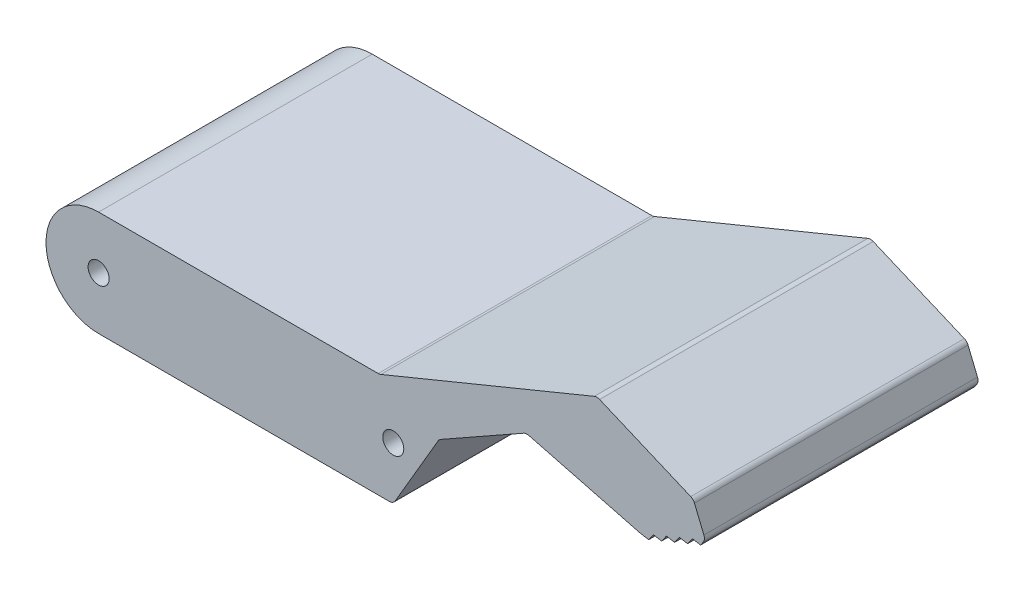
ISO-10303-21;
HEADER;
FILE_DESCRIPTION(('STEP AP214'),'2;1');
FILE_NAME('part.step','',(''),(''),'','','');
FILE_SCHEMA(('AUTOMOTIVE_DESIGN { 1 0 10303 214 1 1 1 1 }'));
ENDSEC;
DATA;
#1=APPLICATION_CONTEXT('core data for automotive mechanical design processes');
#2=APPLICATION_PROTOCOL_DEFINITION('international standard','automotive_design',2000,#1);
#3=PRODUCT_CONTEXT('',#1,'mechanical');
#4=PRODUCT('Part','Part','',(#3));
#5=PRODUCT_RELATED_PRODUCT_CATEGORY('part','',(#4));
#6=PRODUCT_DEFINITION_FORMATION('','',#4);
#7=PRODUCT_DEFINITION_CONTEXT('part definition',#1,'design');
#8=PRODUCT_DEFINITION('design','',#6,#7);
#9=PRODUCT_DEFINITION_SHAPE('','',#8);
#10=(LENGTH_UNIT() NAMED_UNIT(*) SI_UNIT(.MILLI.,.METRE.));
#11=(NAMED_UNIT(*) PLANE_ANGLE_UNIT() SI_UNIT($,.RADIAN.));
#12=(NAMED_UNIT(*) SI_UNIT($,.STERADIAN.) SOLID_ANGLE_UNIT());
#13=UNCERTAINTY_MEASURE_WITH_UNIT(LENGTH_MEASURE(1.E-05),#10,'distance_accuracy_value','');
#14=(GEOMETRIC_REPRESENTATION_CONTEXT(3) GLOBAL_UNCERTAINTY_ASSIGNED_CONTEXT((#13)) GLOBAL_UNIT_ASSIGNED_CONTEXT((#10,
#11,#12)) REPRESENTATION_CONTEXT('',''));
#15=CARTESIAN_POINT('',(0.,0.,0.));
#16=DIRECTION('',(0.,0.,1.));
#17=DIRECTION('',(1.,0.,0.));
#18=AXIS2_PLACEMENT_3D('',#15,#16,#17);
#19=CARTESIAN_POINT('',(34.5920003896083,-20.1914119043618,39.));
#20=DIRECTION('',(0.863640377947011,-0.504108418477161,0.));
#21=DIRECTION('',(0.504108418477161,0.863640377947011,0.));
#22=AXIS2_PLACEMENT_3D('',#19,#20,#21);
#23=PLANE('',#22);
#24=DIRECTION('',(-0.504108418477161,-0.863640377947011,0.));
#25=VECTOR('',#24,1.);
#26=CARTESIAN_POINT('',(34.5920003896083,-20.1914119043618,0.));
#27=LINE('',#26,#25);
#28=CARTESIAN_POINT('',(48.3941661538453,3.45450873533294,0.));
#29=VERTEX_POINT('',#28);
#30=CARTESIAN_POINT('',(42.289452794567,-7.00410841847716,0.));
#31=VERTEX_POINT('',#30);
#32=EDGE_CURVE('E352',#29,#31,#27,.T.);
#33=ORIENTED_EDGE('',*,*,#32,.F.);
#34=DIRECTION('',(0.,0.,-1.));
#35=VECTOR('',#34,1.);
#36=CARTESIAN_POINT('',(48.3941661538453,3.45450873533293,39.));
#37=LINE('',#36,#35);
#38=CARTESIAN_POINT('',(48.3941661538453,3.45450873533294,39.));
#39=VERTEX_POINT('',#38);
#40=EDGE_CURVE('E255',#29,#39,#37,.F.);
#41=ORIENTED_EDGE('',*,*,#40,.T.);
#42=DIRECTION('',(-0.504108418477161,-0.863640377947011,0.));
#43=VECTOR('',#42,1.);
#44=CARTESIAN_POINT('',(34.5920003896083,-20.1914119043618,39.));
#45=LINE('',#44,#43);
#46=CARTESIAN_POINT('',(42.289452794567,-7.00410841847716,39.));
#47=VERTEX_POINT('',#46);
#48=EDGE_CURVE('E769',#39,#47,#45,.T.);
#49=ORIENTED_EDGE('',*,*,#48,.T.);
#50=DIRECTION('',(0.,0.,-1.));
#51=VECTOR('',#50,1.);
#52=CARTESIAN_POINT('',(42.289452794567,-7.00410841847716,0.));
#53=LINE('',#52,#51);
#54=EDGE_CURVE('E252',#47,#31,#53,.T.);
#55=ORIENTED_EDGE('',*,*,#54,.T.);
#56=EDGE_LOOP('',(#33,#41,#49,#55));
#57=FACE_BOUND('',#56,.T.);
#58=ADVANCED_FACE('F35',(#57),#23,.T.);
#59=CARTESIAN_POINT('',(10.1563340407783,-17.9837401161387,39.));
#60=DIRECTION('',(0.49174940484091,-0.870736770119771,0.));
#61=DIRECTION('',(0.870736770119771,0.49174940484091,0.));
#62=AXIS2_PLACEMENT_3D('',#59,#60,#61);
#63=PLANE('',#62);
#64=DIRECTION('',(-0.870736770119771,-0.49174940484091,0.));
#65=VECTOR('',#64,1.);
#66=CARTESIAN_POINT('',(10.1563340407783,-17.9837401161387,39.));
#67=LINE('',#66,#65);
#68=CARTESIAN_POINT('',(60.5780168914764,10.4919524051468,39.));
#69=VERTEX_POINT('',#68);
#70=CARTESIAN_POINT('',(48.7660571269514,3.82113708697554,39.));
#71=VERTEX_POINT('',#70);
#72=EDGE_CURVE('E776',#69,#71,#67,.T.);
#73=ORIENTED_EDGE('',*,*,#72,.T.);
#74=DIRECTION('',(0.,0.,-1.));
#75=VECTOR('',#74,1.);
#76=CARTESIAN_POINT('',(48.7660571269514,3.82113708697554,0.));
#77=LINE('',#76,#75);
#78=CARTESIAN_POINT('',(48.7660571269514,3.82113708697554,0.));
#79=VERTEX_POINT('',#78);
#80=EDGE_CURVE('E244',#71,#79,#77,.T.);
#81=ORIENTED_EDGE('',*,*,#80,.T.);
#82=DIRECTION('',(-0.870736770119771,-0.49174940484091,0.));
#83=VECTOR('',#82,1.);
#84=CARTESIAN_POINT('',(10.1563340407783,-17.9837401161387,0.));
#85=LINE('',#84,#83);
#86=CARTESIAN_POINT('',(60.5780168914764,10.4919524051468,0.));
#87=VERTEX_POINT('',#86);
#88=EDGE_CURVE('E354',#87,#79,#85,.T.);
#89=ORIENTED_EDGE('',*,*,#88,.F.);
#90=DIRECTION('',(0.,0.,-1.));
#91=VECTOR('',#90,1.);
#92=CARTESIAN_POINT('',(60.5780168914764,10.4919524051468,39.));
#93=LINE('',#92,#91);
#94=EDGE_CURVE('E242',#87,#69,#93,.F.);
#95=ORIENTED_EDGE('',*,*,#94,.T.);
#96=EDGE_LOOP('',(#73,#81,#89,#95));
#97=FACE_BOUND('',#96,.T.);
#98=ADVANCED_FACE('F497',(#97),#63,.T.);
#99=CARTESIAN_POINT('',(6.44130494107222,24.8273469280204,39.));
#100=DIRECTION('',(-0.251129667135222,-0.967953454606446,0.));
#101=DIRECTION('',(0.967953454606446,-0.251129667135222,0.));
#102=AXIS2_PLACEMENT_3D('',#99,#100,#101);
#103=PLANE('',#102);
#104=DIRECTION('',(-0.967953454606446,0.251129667135222,0.));
#105=VECTOR('',#104,1.);
#106=CARTESIAN_POINT('',(6.44130494107222,24.8273469280204,39.));
#107=LINE('',#106,#105);
#108=CARTESIAN_POINT('',(77.1999478832336,6.46944514623497,39.));
#109=VERTEX_POINT('',#108);
#110=CARTESIAN_POINT('',(61.3208959634526,10.5891690896335,39.));
#111=VERTEX_POINT('',#110);
#112=EDGE_CURVE('E227',#109,#111,#107,.T.);
#113=ORIENTED_EDGE('',*,*,#112,.T.);
#114=DIRECTION('',(0.,0.,-1.));
#115=VECTOR('',#114,1.);
#116=CARTESIAN_POINT('',(61.3208959634526,10.5891690896335,0.));
#117=LINE('',#116,#115);
#118=CARTESIAN_POINT('',(61.3208959634526,10.5891690896335,0.));
#119=VERTEX_POINT('',#118);
#120=EDGE_CURVE('E279',#111,#119,#117,.T.);
#121=ORIENTED_EDGE('',*,*,#120,.T.);
#122=DIRECTION('',(-0.967953454606446,0.251129667135222,0.));
#123=VECTOR('',#122,1.);
#124=CARTESIAN_POINT('',(6.44130494107222,24.8273469280204,0.));
#125=LINE('',#124,#123);
#126=CARTESIAN_POINT('',(77.1999478832336,6.46944514623497,0.));
#127=VERTEX_POINT('',#126);
#128=EDGE_CURVE('E357',#127,#119,#125,.T.);
#129=ORIENTED_EDGE('',*,*,#128,.F.);
#130=DIRECTION('',(0.,0.,-1.));
#131=VECTOR('',#130,1.);
#132=CARTESIAN_POINT('',(77.1999478832335,6.46944514623497,39.));
#133=LINE('',#132,#131);
#134=EDGE_CURVE('E277',#127,#109,#133,.F.);
#135=ORIENTED_EDGE('',*,*,#134,.T.);
#136=EDGE_LOOP('',(#113,#121,#129,#135));
#137=FACE_BOUND('',#136,.T.);
#138=ADVANCED_FACE('F503',(#137),#103,.T.);
#139=CARTESIAN_POINT('',(3.3552008629179,19.302142192717,39.));
#140=DIRECTION('',(0.171257275030367,0.985226342395073,0.));
#141=DIRECTION('',(-0.985226342395073,0.171257275030367,0.));
#142=AXIS2_PLACEMENT_3D('',#139,#140,#141);
#143=PLANE('',#142);
#144=DIRECTION('',(0.985226342395073,-0.171257275030367,0.));
#145=VECTOR('',#144,1.);
#146=CARTESIAN_POINT('',(3.3552008629179,19.302142192717,39.));
#147=LINE('',#146,#145);
#148=CARTESIAN_POINT('',(77.2798202753384,6.45217225844635,39.));
#149=VERTEX_POINT('',#148);
#150=CARTESIAN_POINT('',(78.4039750829053,6.25676569979893,39.));
#151=VERTEX_POINT('',#150);
#152=EDGE_CURVE('E213',#149,#151,#147,.T.);
#153=ORIENTED_EDGE('',*,*,#152,.F.);
#154=DIRECTION('',(0.,0.,-1.));
#155=VECTOR('',#154,1.);
#156=CARTESIAN_POINT('',(77.2798202753384,6.45217225844634,0.));
#157=LINE('',#156,#155);
#158=CARTESIAN_POINT('',(77.2798202753384,6.45217225844635,0.));
#159=VERTEX_POINT('',#158);
#160=EDGE_CURVE('E282',#149,#159,#157,.T.);
#161=ORIENTED_EDGE('',*,*,#160,.T.);
#162=DIRECTION('',(0.985226342395073,-0.171257275030367,0.));
#163=VECTOR('',#162,1.);
#164=CARTESIAN_POINT('',(3.3552008629179,19.302142192717,0.));
#165=LINE('',#164,#163);
#166=CARTESIAN_POINT('',(78.4039750829053,6.25676569979893,0.));
#167=VERTEX_POINT('',#166);
#168=EDGE_CURVE('E240',#159,#167,#165,.T.);
#169=ORIENTED_EDGE('',*,*,#168,.T.);
#170=DIRECTION('',(0.,0.,-1.));
#171=VECTOR('',#170,1.);
#172=CARTESIAN_POINT('',(78.4039750829053,6.25676569979893,39.));
#173=LINE('',#172,#171);
#174=EDGE_CURVE('E233',#151,#167,#173,.T.);
#175=ORIENTED_EDGE('',*,*,#174,.F.);
#176=EDGE_LOOP('',(#153,#161,#169,#175));
#177=FACE_BOUND('',#176,.T.);
#178=ADVANCED_FACE('F238',(#177),#143,.F.);
#179=CARTESIAN_POINT('',(49.0879376952955,-34.935387273559,39.));
#180=DIRECTION('',(-0.814732571298568,0.579836905746111,0.));
#181=DIRECTION('',(-0.579836905746111,-0.814732571298568,0.));
#182=AXIS2_PLACEMENT_3D('',#179,#180,#181);
#183=PLANE('',#182);
#184=DIRECTION('',(0.579836905746111,0.814732571298568,0.));
#185=VECTOR('',#184,1.);
#186=CARTESIAN_POINT('',(49.0879376952955,-34.935387273559,0.));
#187=LINE('',#186,#185);
#188=CARTESIAN_POINT('',(79.08928736105,7.21970239627707,0.));
#189=VERTEX_POINT('',#188);
#190=EDGE_CURVE('E361',#167,#189,#187,.T.);
#191=ORIENTED_EDGE('',*,*,#190,.T.);
#192=DIRECTION('',(0.,0.,-1.));
#193=VECTOR('',#192,1.);
#194=CARTESIAN_POINT('',(79.08928736105,7.21970239627707,39.));
#195=LINE('',#194,#193);
#196=CARTESIAN_POINT('',(79.08928736105,7.21970239627707,39.));
#197=VERTEX_POINT('',#196);
#198=EDGE_CURVE('E235',#197,#189,#195,.T.);
#199=ORIENTED_EDGE('',*,*,#198,.F.);
#200=DIRECTION('',(0.579836905746111,0.814732571298568,0.));
#201=VECTOR('',#200,1.);
#202=CARTESIAN_POINT('',(49.0879376952955,-34.935387273559,39.));
#203=LINE('',#202,#201);
#204=EDGE_CURVE('E218',#151,#197,#203,.T.);
#205=ORIENTED_EDGE('',*,*,#204,.F.);
#206=ORIENTED_EDGE('',*,*,#174,.T.);
#207=EDGE_LOOP('',(#191,#199,#205,#206));
#208=FACE_BOUND('',#207,.T.);
#209=ADVANCED_FACE('F232',(#208),#183,.F.);
#210=CARTESIAN_POINT('',(3.53777401595302,20.3524676737947,39.));
#211=DIRECTION('',(0.171257275030367,0.985226342395073,0.));
#212=DIRECTION('',(-0.985226342395073,0.171257275030367,0.));
#213=AXIS2_PLACEMENT_3D('',#210,#211,#212);
#214=PLANE('',#213);
#215=DIRECTION('',(0.985226342395073,-0.171257275030367,0.));
#216=VECTOR('',#215,1.);
#217=CARTESIAN_POINT('',(3.53777401595302,20.3524676737947,0.));
#218=LINE('',#217,#216);
#219=CARTESIAN_POINT('',(80.2537315392384,7.01729252526535,0.));
#220=VERTEX_POINT('',#219);
#221=EDGE_CURVE('E363',#189,#220,#218,.T.);
#222=ORIENTED_EDGE('',*,*,#221,.T.);
#223=DIRECTION('',(0.,0.,-1.));
#224=VECTOR('',#223,1.);
#225=CARTESIAN_POINT('',(80.2537315392384,7.01729252526535,39.));
#226=LINE('',#225,#224);
#227=CARTESIAN_POINT('',(80.2537315392384,7.01729252526535,39.));
#228=VERTEX_POINT('',#227);
#229=EDGE_CURVE('E246',#228,#220,#226,.T.);
#230=ORIENTED_EDGE('',*,*,#229,.F.);
#231=DIRECTION('',(0.985226342395073,-0.171257275030367,0.));
#232=VECTOR('',#231,1.);
#233=CARTESIAN_POINT('',(3.53777401595302,20.3524676737947,39.));
#234=LINE('',#233,#232);
#235=EDGE_CURVE('E236',#197,#228,#234,.T.);
#236=ORIENTED_EDGE('',*,*,#235,.F.);
#237=ORIENTED_EDGE('',*,*,#198,.T.);
#238=EDGE_LOOP('',(#222,#230,#236,#237));
#239=FACE_BOUND('',#238,.T.);
#240=ADVANCED_FACE('F428',(#239),#214,.F.);
#241=CARTESIAN_POINT('',(49.9565039760335,-35.553537084184,39.));
#242=DIRECTION('',(-0.814732571298571,0.579836905746107,0.));
#243=DIRECTION('',(-0.579836905746107,-0.814732571298571,0.));
#244=AXIS2_PLACEMENT_3D('',#241,#242,#243);
#245=PLANE('',#244);
#246=DIRECTION('',(0.579836905746107,0.814732571298571,0.));
#247=VECTOR('',#246,1.);
#248=CARTESIAN_POINT('',(49.9565039760335,-35.553537084184,0.));
#249=LINE('',#248,#247);
#250=CARTESIAN_POINT('',(80.9390438173831,7.98022922174349,0.));
#251=VERTEX_POINT('',#250);
#252=EDGE_CURVE('E366',#220,#251,#249,.T.);
#253=ORIENTED_EDGE('',*,*,#252,.T.);
#254=DIRECTION('',(0.,0.,-1.));
#255=VECTOR('',#254,1.);
#256=CARTESIAN_POINT('',(80.9390438173831,7.98022922174349,39.));
#257=LINE('',#256,#255);
#258=CARTESIAN_POINT('',(80.9390438173831,7.98022922174349,39.));
#259=VERTEX_POINT('',#258);
#260=EDGE_CURVE('E418',#259,#251,#257,.T.);
#261=ORIENTED_EDGE('',*,*,#260,.F.);
#262=DIRECTION('',(0.579836905746107,0.814732571298571,0.));
#263=VECTOR('',#262,1.);
#264=CARTESIAN_POINT('',(49.9565039760335,-35.553537084184,39.));
#265=LINE('',#264,#263);
#266=EDGE_CURVE('E426',#228,#259,#265,.T.);
#267=ORIENTED_EDGE('',*,*,#266,.F.);
#268=ORIENTED_EDGE('',*,*,#229,.T.);
#269=EDGE_LOOP('',(#253,#261,#267,#268));
#270=FACE_BOUND('',#269,.T.);
#271=ADVANCED_FACE('F423',(#270),#245,.F.);
#272=CARTESIAN_POINT('',(3.72034716898818,21.4027931548725,39.));
#273=DIRECTION('',(0.171257275030368,0.985226342395073,0.));
#274=DIRECTION('',(-0.985226342395073,0.171257275030368,0.));
#275=AXIS2_PLACEMENT_3D('',#272,#273,#274);
#276=PLANE('',#275);
#277=DIRECTION('',(0.985226342395073,-0.171257275030368,0.));
#278=VECTOR('',#277,1.);
#279=CARTESIAN_POINT('',(3.72034716898818,21.4027931548725,0.));
#280=LINE('',#279,#278);
#281=CARTESIAN_POINT('',(82.1034879955715,7.77781935073177,0.));
#282=VERTEX_POINT('',#281);
#283=EDGE_CURVE('E369',#251,#282,#280,.T.);
#284=ORIENTED_EDGE('',*,*,#283,.T.);
#285=DIRECTION('',(0.,0.,-1.));
#286=VECTOR('',#285,1.);
#287=CARTESIAN_POINT('',(82.1034879955715,7.77781935073177,39.));
#288=LINE('',#287,#286);
#289=CARTESIAN_POINT('',(82.1034879955715,7.77781935073177,39.));
#290=VERTEX_POINT('',#289);
#291=EDGE_CURVE('E415',#290,#282,#288,.T.);
#292=ORIENTED_EDGE('',*,*,#291,.F.);
#293=DIRECTION('',(0.985226342395073,-0.171257275030368,0.));
#294=VECTOR('',#293,1.);
#295=CARTESIAN_POINT('',(3.72034716898818,21.4027931548725,39.));
#296=LINE('',#295,#294);
#297=EDGE_CURVE('E433',#259,#290,#296,.T.);
#298=ORIENTED_EDGE('',*,*,#297,.F.);
#299=ORIENTED_EDGE('',*,*,#260,.T.);
#300=EDGE_LOOP('',(#284,#292,#298,#299));
#301=FACE_BOUND('',#300,.T.);
#302=ADVANCED_FACE('F431',(#301),#276,.F.);
#303=CARTESIAN_POINT('',(50.8250702567709,-36.1716868948092,39.));
#304=DIRECTION('',(-0.814732571298569,0.57983690574611,0.));
#305=DIRECTION('',(-0.57983690574611,-0.814732571298569,0.));
#306=AXIS2_PLACEMENT_3D('',#303,#304,#305);
#307=PLANE('',#306);
#308=DIRECTION('',(0.579836905746109,0.814732571298569,0.));
#309=VECTOR('',#308,1.);
#310=CARTESIAN_POINT('',(50.8250702567709,-36.1716868948092,0.));
#311=LINE('',#310,#309);
#312=CARTESIAN_POINT('',(82.7888002737162,8.7407560472099,0.));
#313=VERTEX_POINT('',#312);
#314=EDGE_CURVE('E372',#282,#313,#311,.T.);
#315=ORIENTED_EDGE('',*,*,#314,.T.);
#316=DIRECTION('',(0.,0.,-1.));
#317=VECTOR('',#316,1.);
#318=CARTESIAN_POINT('',(82.7888002737162,8.7407560472099,39.));
#319=LINE('',#318,#317);
#320=CARTESIAN_POINT('',(82.7888002737162,8.7407560472099,39.));
#321=VERTEX_POINT('',#320);
#322=EDGE_CURVE('E412',#321,#313,#319,.T.);
#323=ORIENTED_EDGE('',*,*,#322,.F.);
#324=DIRECTION('',(0.579836905746109,0.814732571298569,0.));
#325=VECTOR('',#324,1.);
#326=CARTESIAN_POINT('',(50.8250702567709,-36.1716868948092,39.));
#327=LINE('',#326,#325);
#328=EDGE_CURVE('E435',#290,#321,#327,.T.);
#329=ORIENTED_EDGE('',*,*,#328,.F.);
#330=ORIENTED_EDGE('',*,*,#291,.T.);
#331=EDGE_LOOP('',(#315,#323,#329,#330));
#332=FACE_BOUND('',#331,.T.);
#333=ADVANCED_FACE('F487',(#332),#307,.F.);
#334=CARTESIAN_POINT('',(3.90292032202358,22.4531186359508,39.));
#335=DIRECTION('',(0.171257275030376,0.985226342395071,0.));
#336=DIRECTION('',(-0.985226342395071,0.171257275030376,0.));
#337=AXIS2_PLACEMENT_3D('',#334,#335,#336);
#338=PLANE('',#337);
#339=DIRECTION('',(0.985226342395071,-0.171257275030376,0.));
#340=VECTOR('',#339,1.);
#341=CARTESIAN_POINT('',(3.90292032202358,22.4531186359508,0.));
#342=LINE('',#341,#340);
#343=CARTESIAN_POINT('',(83.9532444519046,8.53834617619818,0.));
#344=VERTEX_POINT('',#343);
#345=EDGE_CURVE('E375',#313,#344,#342,.T.);
#346=ORIENTED_EDGE('',*,*,#345,.T.);
#347=DIRECTION('',(0.,0.,-1.));
#348=VECTOR('',#347,1.);
#349=CARTESIAN_POINT('',(83.9532444519046,8.53834617619818,39.));
#350=LINE('',#349,#348);
#351=CARTESIAN_POINT('',(83.9532444519046,8.53834617619818,39.));
#352=VERTEX_POINT('',#351);
#353=EDGE_CURVE('E409',#352,#344,#350,.T.);
#354=ORIENTED_EDGE('',*,*,#353,.F.);
#355=DIRECTION('',(0.985226342395071,-0.171257275030376,0.));
#356=VECTOR('',#355,1.);
#357=CARTESIAN_POINT('',(3.90292032202358,22.4531186359508,39.));
#358=LINE('',#357,#356);
#359=EDGE_CURVE('E441',#321,#352,#358,.T.);
#360=ORIENTED_EDGE('',*,*,#359,.F.);
#361=ORIENTED_EDGE('',*,*,#322,.T.);
#362=EDGE_LOOP('',(#346,#354,#360,#361));
#363=FACE_BOUND('',#362,.T.);
#364=ADVANCED_FACE('F484',(#363),#338,.F.);
#365=CARTESIAN_POINT('',(51.69363653751,-36.789836705434,39.));
#366=DIRECTION('',(-0.814732571298579,0.579836905746095,0.));
#367=DIRECTION('',(-0.579836905746095,-0.814732571298579,0.));
#368=AXIS2_PLACEMENT_3D('',#365,#366,#367);
#369=PLANE('',#368);
#370=DIRECTION('',(0.579836905746095,0.814732571298579,0.));
#371=VECTOR('',#370,1.);
#372=CARTESIAN_POINT('',(51.69363653751,-36.789836705434,0.));
#373=LINE('',#372,#371);
#374=CARTESIAN_POINT('',(84.6385567300492,9.50128287267631,0.));
#375=VERTEX_POINT('',#374);
#376=EDGE_CURVE('E378',#344,#375,#373,.T.);
#377=ORIENTED_EDGE('',*,*,#376,.T.);
#378=DIRECTION('',(0.,0.,-1.));
#379=VECTOR('',#378,1.);
#380=CARTESIAN_POINT('',(84.6385567300492,9.50128287267631,39.));
#381=LINE('',#380,#379);
#382=CARTESIAN_POINT('',(84.6385567300492,9.50128287267631,39.));
#383=VERTEX_POINT('',#382);
#384=EDGE_CURVE('E406',#383,#375,#381,.T.);
#385=ORIENTED_EDGE('',*,*,#384,.F.);
#386=DIRECTION('',(0.579836905746095,0.814732571298579,0.));
#387=VECTOR('',#386,1.);
#388=CARTESIAN_POINT('',(51.69363653751,-36.789836705434,39.));
#389=LINE('',#388,#387);
#390=EDGE_CURVE('E444',#352,#383,#389,.T.);
#391=ORIENTED_EDGE('',*,*,#390,.F.);
#392=ORIENTED_EDGE('',*,*,#353,.T.);
#393=EDGE_LOOP('',(#377,#385,#391,#392));
#394=FACE_BOUND('',#393,.T.);
#395=ADVANCED_FACE('F482',(#394),#369,.F.);
#396=CARTESIAN_POINT('',(4.08549347505868,23.5034441170285,39.));
#397=DIRECTION('',(0.171257275030375,0.985226342395072,0.));
#398=DIRECTION('',(-0.985226342395072,0.171257275030375,0.));
#399=AXIS2_PLACEMENT_3D('',#396,#397,#398);
#400=PLANE('',#399);
#401=DIRECTION('',(0.985226342395071,-0.171257275030375,0.));
#402=VECTOR('',#401,1.);
#403=CARTESIAN_POINT('',(4.08549347505868,23.5034441170285,0.));
#404=LINE('',#403,#402);
#405=CARTESIAN_POINT('',(85.8030009082377,9.29887300166459,0.));
#406=VERTEX_POINT('',#405);
#407=EDGE_CURVE('E381',#375,#406,#404,.T.);
#408=ORIENTED_EDGE('',*,*,#407,.T.);
#409=DIRECTION('',(0.,0.,-1.));
#410=VECTOR('',#409,1.);
#411=CARTESIAN_POINT('',(85.8030009082377,9.29887300166459,39.));
#412=LINE('',#411,#410);
#413=CARTESIAN_POINT('',(85.8030009082377,9.29887300166459,39.));
#414=VERTEX_POINT('',#413);
#415=EDGE_CURVE('E403',#414,#406,#412,.T.);
#416=ORIENTED_EDGE('',*,*,#415,.F.);
#417=DIRECTION('',(0.985226342395071,-0.171257275030375,0.));
#418=VECTOR('',#417,1.);
#419=CARTESIAN_POINT('',(4.08549347505868,23.5034441170285,39.));
#420=LINE('',#419,#418);
#421=EDGE_CURVE('E447',#383,#414,#420,.T.);
#422=ORIENTED_EDGE('',*,*,#421,.F.);
#423=ORIENTED_EDGE('',*,*,#384,.T.);
#424=EDGE_LOOP('',(#408,#416,#422,#423));
#425=FACE_BOUND('',#424,.T.);
#426=ADVANCED_FACE('F478',(#425),#400,.F.);
#427=CARTESIAN_POINT('',(52.562202818246,-37.4079865160595,39.));
#428=DIRECTION('',(-0.814732571298567,0.579836905746111,0.));
#429=DIRECTION('',(-0.579836905746111,-0.814732571298567,0.));
#430=AXIS2_PLACEMENT_3D('',#427,#428,#429);
#431=PLANE('',#430);
#432=DIRECTION('',(0.579836905746111,0.814732571298567,0.));
#433=VECTOR('',#432,1.);
#434=CARTESIAN_POINT('',(52.562202818246,-37.4079865160595,0.));
#435=LINE('',#434,#433);
#436=CARTESIAN_POINT('',(86.1682981588578,9.81215452158268,0.));
#437=VERTEX_POINT('',#436);
#438=EDGE_CURVE('E384',#406,#437,#435,.T.);
#439=ORIENTED_EDGE('',*,*,#438,.T.);
#440=DIRECTION('',(0.,0.,-1.));
#441=VECTOR('',#440,1.);
#442=CARTESIAN_POINT('',(86.1682981588578,9.81215452158268,39.));
#443=LINE('',#442,#441);
#444=CARTESIAN_POINT('',(86.1682981588578,9.81215452158268,39.));
#445=VERTEX_POINT('',#444);
#446=EDGE_CURVE('E289',#437,#445,#443,.F.);
#447=ORIENTED_EDGE('',*,*,#446,.T.);
#448=DIRECTION('',(0.579836905746111,0.814732571298567,0.));
#449=VECTOR('',#448,1.);
#450=CARTESIAN_POINT('',(52.562202818246,-37.4079865160595,39.));
#451=LINE('',#450,#449);
#452=EDGE_CURVE('E450',#414,#445,#451,.T.);
#453=ORIENTED_EDGE('',*,*,#452,.F.);
#454=ORIENTED_EDGE('',*,*,#415,.T.);
#455=EDGE_LOOP('',(#439,#447,#453,#454));
#456=FACE_BOUND('',#455,.T.);
#457=ADVANCED_FACE('F475',(#456),#431,.F.);
#458=CARTESIAN_POINT('',(77.5911316391743,31.9015710570176,39.));
#459=DIRECTION('',(0.92487822816655,0.380263412733204,0.));
#460=DIRECTION('',(-0.380263412733204,0.92487822816655,0.));
#461=AXIS2_PLACEMENT_3D('',#458,#459,#460);
#462=PLANE('',#461);
#463=DIRECTION('',(0.380263412733204,-0.92487822816655,0.));
#464=VECTOR('',#463,1.);
#465=CARTESIAN_POINT('',(77.5911316391743,31.9015710570176,39.));
#466=LINE('',#465,#464);
#467=CARTESIAN_POINT('',(84.9335367393822,14.043343333369,39.));
#468=VERTEX_POINT('',#467);
#469=CARTESIAN_POINT('',(86.2784438157257,10.772254840062,39.));
#470=VERTEX_POINT('',#469);
#471=EDGE_CURVE('E453',#468,#470,#466,.T.);
#472=ORIENTED_EDGE('',*,*,#471,.T.);
#473=DIRECTION('',(0.,0.,-1.));
#474=VECTOR('',#473,1.);
#475=CARTESIAN_POINT('',(86.2784438157257,10.772254840062,0.));
#476=LINE('',#475,#474);
#477=CARTESIAN_POINT('',(86.2784438157257,10.772254840062,0.));
#478=VERTEX_POINT('',#477);
#479=EDGE_CURVE('E286',#470,#478,#476,.T.);
#480=ORIENTED_EDGE('',*,*,#479,.T.);
#481=DIRECTION('',(0.380263412733204,-0.92487822816655,0.));
#482=VECTOR('',#481,1.);
#483=CARTESIAN_POINT('',(77.5911316391743,31.9015710570176,0.));
#484=LINE('',#483,#482);
#485=CARTESIAN_POINT('',(84.9335367393822,14.043343333369,0.));
#486=VERTEX_POINT('',#485);
#487=EDGE_CURVE('E387',#486,#478,#484,.T.);
#488=ORIENTED_EDGE('',*,*,#487,.F.);
#489=DIRECTION('',(0.,0.,-1.));
#490=VECTOR('',#489,1.);
#491=CARTESIAN_POINT('',(84.9335367393822,14.043343333369,39.));
#492=LINE('',#491,#490);
#493=EDGE_CURVE('E284',#486,#468,#492,.F.);
#494=ORIENTED_EDGE('',*,*,#493,.T.);
#495=EDGE_LOOP('',(#472,#480,#488,#494));
#496=FACE_BOUND('',#495,.T.);
#497=ADVANCED_FACE('F467',(#496),#462,.T.);
#498=CARTESIAN_POINT('',(18.048535975218,42.657114903488,39.));
#499=DIRECTION('',(0.389663705776961,0.920957217464615,0.));
#500=DIRECTION('',(-0.920957217464615,0.389663705776961,0.));
#501=AXIS2_PLACEMENT_3D('',#498,#499,#500);
#502=PLANE('',#501);
#503=DIRECTION('',(0.920957217464615,-0.389663705776961,0.));
#504=VECTOR('',#503,1.);
#505=CARTESIAN_POINT('',(18.048535975218,42.657114903488,39.));
#506=LINE('',#505,#504);
#507=CARTESIAN_POINT('',(71.4175664450873,20.0762894403206,39.));
#508=VERTEX_POINT('',#507);
#509=CARTESIAN_POINT('',(84.3983222169927,14.5840371381004,39.));
#510=VERTEX_POINT('',#509);
#511=EDGE_CURVE('E340',#508,#510,#506,.T.);
#512=ORIENTED_EDGE('',*,*,#511,.T.);
#513=DIRECTION('',(0.,0.,-1.));
#514=VECTOR('',#513,1.);
#515=CARTESIAN_POINT('',(84.3983222169926,14.5840371381004,39.));
#516=LINE('',#515,#514);
#517=CARTESIAN_POINT('',(84.3983222169927,14.5840371381004,0.));
#518=VERTEX_POINT('',#517);
#519=EDGE_CURVE('E293',#510,#518,#516,.T.);
#520=ORIENTED_EDGE('',*,*,#519,.T.);
#521=DIRECTION('',(0.920957217464615,-0.389663705776961,0.));
#522=VECTOR('',#521,1.);
#523=CARTESIAN_POINT('',(18.048535975218,42.657114903488,0.));
#524=LINE('',#523,#522);
#525=CARTESIAN_POINT('',(71.4175664450873,20.0762894403206,0.));
#526=VERTEX_POINT('',#525);
#527=EDGE_CURVE('E327',#526,#518,#524,.T.);
#528=ORIENTED_EDGE('',*,*,#527,.F.);
#529=DIRECTION('',(0.,0.,-1.));
#530=VECTOR('',#529,1.);
#531=CARTESIAN_POINT('',(71.4175664450873,20.0762894403206,39.));
#532=LINE('',#531,#530);
#533=EDGE_CURVE('E291',#526,#508,#532,.F.);
#534=ORIENTED_EDGE('',*,*,#533,.T.);
#535=EDGE_LOOP('',(#512,#520,#528,#534));
#536=FACE_BOUND('',#535,.T.);
#537=ADVANCED_FACE('F458',(#536),#502,.T.);
#538=CARTESIAN_POINT('',(3.15351040015397,-7.66998089675667,39.));
#539=DIRECTION('',(-0.380263412733206,0.924878228166549,0.));
#540=DIRECTION('',(-0.924878228166549,-0.380263412733207,0.));
#541=AXIS2_PLACEMENT_3D('',#538,#539,#540);
#542=PLANE('',#541);
#543=DIRECTION('',(0.924878228166549,0.380263412733207,0.));
#544=VECTOR('',#543,1.);
#545=CARTESIAN_POINT('',(3.15351040015397,-7.66998089675667,39.));
#546=LINE('',#545,#544);
#547=CARTESIAN_POINT('',(40.2327114807882,7.57512177183346,39.));
#548=VERTEX_POINT('',#547);
#549=CARTESIAN_POINT('',(70.6476393265771,20.0802104510225,39.));
#550=VERTEX_POINT('',#549);
#551=EDGE_CURVE('E336',#548,#550,#546,.T.);
#552=ORIENTED_EDGE('',*,*,#551,.T.);
#553=DIRECTION('',(0.,0.,-1.));
#554=VECTOR('',#553,1.);
#555=CARTESIAN_POINT('',(70.6476393265771,20.0802104510225,39.));
#556=LINE('',#555,#554);
#557=CARTESIAN_POINT('',(70.6476393265771,20.0802104510225,0.));
#558=VERTEX_POINT('',#557);
#559=EDGE_CURVE('E298',#550,#558,#556,.T.);
#560=ORIENTED_EDGE('',*,*,#559,.T.);
#561=DIRECTION('',(0.924878228166549,0.380263412733207,0.));
#562=VECTOR('',#561,1.);
#563=CARTESIAN_POINT('',(3.15351040015397,-7.66998089675667,0.));
#564=LINE('',#563,#562);
#565=CARTESIAN_POINT('',(40.2327114807882,7.57512177183346,0.));
#566=VERTEX_POINT('',#565);
#567=EDGE_CURVE('E317',#566,#558,#564,.T.);
#568=ORIENTED_EDGE('',*,*,#567,.F.);
#569=DIRECTION('',(0.,0.,-1.));
#570=VECTOR('',#569,1.);
#571=CARTESIAN_POINT('',(40.2327114807882,7.57512177183345,39.));
#572=LINE('',#571,#570);
#573=EDGE_CURVE('E296',#566,#548,#572,.F.);
#574=ORIENTED_EDGE('',*,*,#573,.T.);
#575=EDGE_LOOP('',(#552,#560,#568,#574));
#576=FACE_BOUND('',#575,.T.);
#577=ADVANCED_FACE('F325',(#576),#542,.T.);
#578=CARTESIAN_POINT('',(0.,7.5,39.));
#579=DIRECTION('',(0.,1.,0.));
#580=DIRECTION('',(-1.,0.,0.));
#581=AXIS2_PLACEMENT_3D('',#578,#579,#580);
#582=PLANE('',#581);
#583=DIRECTION('',(1.,0.,0.));
#584=VECTOR('',#583,1.);
#585=CARTESIAN_POINT('',(0.,7.5,39.));
#586=LINE('',#585,#584);
#587=CARTESIAN_POINT('',(0.,7.5,39.));
#588=VERTEX_POINT('',#587);
#589=CARTESIAN_POINT('',(39.852448068055,7.5,39.));
#590=VERTEX_POINT('',#589);
#591=EDGE_CURVE('E331',#588,#590,#586,.T.);
#592=ORIENTED_EDGE('',*,*,#591,.T.);
#593=DIRECTION('',(0.,0.,-1.));
#594=VECTOR('',#593,1.);
#595=CARTESIAN_POINT('',(39.852448068055,7.5,0.));
#596=LINE('',#595,#594);
#597=CARTESIAN_POINT('',(39.852448068055,7.5,0.));
#598=VERTEX_POINT('',#597);
#599=EDGE_CURVE('E301',#590,#598,#596,.T.);
#600=ORIENTED_EDGE('',*,*,#599,.T.);
#601=DIRECTION('',(1.,0.,0.));
#602=VECTOR('',#601,1.);
#603=CARTESIAN_POINT('',(0.,7.5,0.));
#604=LINE('',#603,#602);
#605=CARTESIAN_POINT('',(0.,7.5,0.));
#606=VERTEX_POINT('',#605);
#607=EDGE_CURVE('E320',#606,#598,#604,.T.);
#608=ORIENTED_EDGE('',*,*,#607,.F.);
#609=DIRECTION('',(0.,0.,-1.));
#610=VECTOR('',#609,1.);
#611=CARTESIAN_POINT('',(0.,7.5,39.));
#612=LINE('',#611,#610);
#613=EDGE_CURVE('E332',#588,#606,#612,.T.);
#614=ORIENTED_EDGE('',*,*,#613,.F.);
#615=EDGE_LOOP('',(#592,#600,#608,#614));
#616=FACE_BOUND('',#615,.T.);
#617=ADVANCED_FACE('F330',(#616),#582,.T.);
#618=CARTESIAN_POINT('',(0.,0.,39.));
#619=DIRECTION('',(0.,0.,-1.));
#620=DIRECTION('',(-1.,0.,0.));
#621=AXIS2_PLACEMENT_3D('',#618,#619,#620);
#622=CYLINDRICAL_SURFACE('',#621,7.5);
#623=CARTESIAN_POINT('',(0.,0.,0.));
#624=DIRECTION('',(0.,0.,1.));
#625=DIRECTION('',(1.,0.,0.));
#626=AXIS2_PLACEMENT_3D('',#623,#624,#625);
#627=CIRCLE('',#626,7.5);
#628=CARTESIAN_POINT('',(0.,-7.5,0.));
#629=VERTEX_POINT('',#628);
#630=EDGE_CURVE('E393',#606,#629,#627,.T.);
#631=ORIENTED_EDGE('',*,*,#630,.T.);
#632=DIRECTION('',(0.,0.,-1.));
#633=VECTOR('',#632,1.);
#634=CARTESIAN_POINT('',(0.,-7.5,39.));
#635=LINE('',#634,#633);
#636=CARTESIAN_POINT('',(0.,-7.5,39.));
#637=VERTEX_POINT('',#636);
#638=EDGE_CURVE('E345',#637,#629,#635,.T.);
#639=ORIENTED_EDGE('',*,*,#638,.F.);
#640=CARTESIAN_POINT('',(0.,0.,39.));
#641=DIRECTION('',(0.,0.,1.));
#642=DIRECTION('',(1.,0.,0.));
#643=AXIS2_PLACEMENT_3D('',#640,#641,#642);
#644=CIRCLE('',#643,7.5);
#645=EDGE_CURVE('E335',#588,#637,#644,.T.);
#646=ORIENTED_EDGE('',*,*,#645,.F.);
#647=ORIENTED_EDGE('',*,*,#613,.T.);
#648=EDGE_LOOP('',(#631,#639,#646,#647));
#649=FACE_BOUND('',#648,.T.);
#650=ADVANCED_FACE('F513',(#649),#622,.T.);
#651=CARTESIAN_POINT('',(0.,0.,39.));
#652=DIRECTION('',(0.,0.,-1.));
#653=DIRECTION('',(-1.,0.,0.));
#654=AXIS2_PLACEMENT_3D('',#651,#652,#653);
#655=CYLINDRICAL_SURFACE('',#654,1.5);
#656=CARTESIAN_POINT('',(0.,0.,39.));
#657=DIRECTION('',(0.,0.,1.));
#658=DIRECTION('',(1.,0.,0.));
#659=AXIS2_PLACEMENT_3D('',#656,#657,#658);
#660=CIRCLE('',#659,1.5);
#661=CARTESIAN_POINT('',(1.5,0.,39.));
#662=VERTEX_POINT('',#661);
#663=EDGE_CURVE('E781',#662,#662,#660,.T.);
#664=ORIENTED_EDGE('',*,*,#663,.T.);
#665=EDGE_LOOP('',(#664));
#666=FACE_BOUND('',#665,.T.);
#667=CARTESIAN_POINT('',(0.,0.,0.));
#668=DIRECTION('',(0.,0.,1.));
#669=DIRECTION('',(1.,0.,0.));
#670=AXIS2_PLACEMENT_3D('',#667,#668,#669);
#671=CIRCLE('',#670,1.5);
#672=CARTESIAN_POINT('',(1.5,0.,0.));
#673=VERTEX_POINT('',#672);
#674=EDGE_CURVE('E349',#673,#673,#671,.T.);
#675=ORIENTED_EDGE('',*,*,#674,.F.);
#676=EDGE_LOOP('',(#675));
#677=FACE_BOUND('',#676,.T.);
#678=ADVANCED_FACE('F509',(#666,#677),#655,.F.);
#679=CARTESIAN_POINT('',(42.,0.,39.));
#680=DIRECTION('',(0.,0.,-1.));
#681=DIRECTION('',(-1.,0.,0.));
#682=AXIS2_PLACEMENT_3D('',#679,#680,#681);
#683=CYLINDRICAL_SURFACE('',#682,1.5);
#684=CARTESIAN_POINT('',(42.,0.,39.));
#685=DIRECTION('',(0.,0.,1.));
#686=DIRECTION('',(1.,0.,0.));
#687=AXIS2_PLACEMENT_3D('',#684,#685,#686);
#688=CIRCLE('',#687,1.5);
#689=CARTESIAN_POINT('',(43.5,0.,39.));
#690=VERTEX_POINT('',#689);
#691=EDGE_CURVE('E399',#690,#690,#688,.T.);
#692=ORIENTED_EDGE('',*,*,#691,.T.);
#693=EDGE_LOOP('',(#692));
#694=FACE_BOUND('',#693,.T.);
#695=CARTESIAN_POINT('',(42.,0.,0.));
#696=DIRECTION('',(0.,0.,1.));
#697=DIRECTION('',(1.,0.,0.));
#698=AXIS2_PLACEMENT_3D('',#695,#696,#697);
#699=CIRCLE('',#698,1.5);
#700=CARTESIAN_POINT('',(43.5,0.,0.));
#701=VERTEX_POINT('',#700);
#702=EDGE_CURVE('E346',#701,#701,#699,.T.);
#703=ORIENTED_EDGE('',*,*,#702,.F.);
#704=EDGE_LOOP('',(#703));
#705=FACE_BOUND('',#704,.T.);
#706=ADVANCED_FACE('F512',(#694,#705),#683,.F.);
#707=CARTESIAN_POINT('',(0.,-7.5,39.));
#708=DIRECTION('',(0.,1.,0.));
#709=DIRECTION('',(-1.,0.,0.));
#710=AXIS2_PLACEMENT_3D('',#707,#708,#709);
#711=PLANE('',#710);
#712=DIRECTION('',(1.,0.,0.));
#713=VECTOR('',#712,1.);
#714=CARTESIAN_POINT('',(0.,-7.5,0.));
#715=LINE('',#714,#713);
#716=CARTESIAN_POINT('',(41.42581241662,-7.5,0.));
#717=VERTEX_POINT('',#716);
#718=EDGE_CURVE('E396',#629,#717,#715,.T.);
#719=ORIENTED_EDGE('',*,*,#718,.T.);
#720=DIRECTION('',(0.,0.,-1.));
#721=VECTOR('',#720,1.);
#722=CARTESIAN_POINT('',(41.42581241662,-7.5,39.));
#723=LINE('',#722,#721);
#724=CARTESIAN_POINT('',(41.42581241662,-7.5,39.));
#725=VERTEX_POINT('',#724);
#726=EDGE_CURVE('E267',#717,#725,#723,.F.);
#727=ORIENTED_EDGE('',*,*,#726,.T.);
#728=DIRECTION('',(1.,0.,0.));
#729=VECTOR('',#728,1.);
#730=CARTESIAN_POINT('',(0.,-7.5,39.));
#731=LINE('',#730,#729);
#732=EDGE_CURVE('E338',#637,#725,#731,.T.);
#733=ORIENTED_EDGE('',*,*,#732,.F.);
#734=ORIENTED_EDGE('',*,*,#638,.T.);
#735=EDGE_LOOP('',(#719,#727,#733,#734));
#736=FACE_BOUND('',#735,.T.);
#737=ADVANCED_FACE('F517',(#736),#711,.F.);
#738=CARTESIAN_POINT('',(0.,0.,39.));
#739=DIRECTION('',(0.,0.,1.));
#740=DIRECTION('',(1.,0.,0.));
#741=AXIS2_PLACEMENT_3D('',#738,#739,#740);
#742=PLANE('',#741);
#743=ORIENTED_EDGE('',*,*,#691,.F.);
#744=EDGE_LOOP('',(#743));
#745=FACE_BOUND('',#744,.T.);
#746=ORIENTED_EDGE('',*,*,#663,.F.);
#747=EDGE_LOOP('',(#746));
#748=FACE_BOUND('',#747,.T.);
#749=ORIENTED_EDGE('',*,*,#732,.T.);
#750=CARTESIAN_POINT('',(41.42581241662,-6.5,39.));
#751=DIRECTION('',(0.,0.,1.));
#752=DIRECTION('',(1.,0.,0.));
#753=AXIS2_PLACEMENT_3D('',#750,#751,#752);
#754=CIRCLE('',#753,1.);
#755=EDGE_CURVE('E275',#725,#47,#754,.T.);
#756=ORIENTED_EDGE('',*,*,#755,.T.);
#757=ORIENTED_EDGE('',*,*,#48,.F.);
#758=CARTESIAN_POINT('',(49.2578065317923,2.95040031685577,39.));
#759=DIRECTION('',(0.,0.,1.));
#760=DIRECTION('',(1.,0.,0.));
#761=AXIS2_PLACEMENT_3D('',#758,#759,#760);
#762=CIRCLE('',#761,1.);
#763=EDGE_CURVE('E306',#39,#71,#762,.F.);
#764=ORIENTED_EDGE('',*,*,#763,.T.);
#765=ORIENTED_EDGE('',*,*,#72,.F.);
#766=CARTESIAN_POINT('',(61.0697662963173,9.62121563502706,39.));
#767=DIRECTION('',(0.,0.,1.));
#768=DIRECTION('',(1.,0.,0.));
#769=AXIS2_PLACEMENT_3D('',#766,#767,#768);
#770=CIRCLE('',#769,1.);
#771=EDGE_CURVE('E310',#69,#111,#770,.F.);
#772=ORIENTED_EDGE('',*,*,#771,.T.);
#773=ORIENTED_EDGE('',*,*,#112,.F.);
#774=CARTESIAN_POINT('',(77.4510775503687,7.43739860084142,39.));
#775=DIRECTION('',(0.,0.,1.));
#776=DIRECTION('',(1.,0.,0.));
#777=AXIS2_PLACEMENT_3D('',#774,#775,#776);
#778=CIRCLE('',#777,1.);
#779=EDGE_CURVE('E222',#109,#149,#778,.T.);
#780=ORIENTED_EDGE('',*,*,#779,.T.);
#781=ORIENTED_EDGE('',*,*,#152,.T.);
#782=ORIENTED_EDGE('',*,*,#204,.T.);
#783=ORIENTED_EDGE('',*,*,#235,.T.);
#784=ORIENTED_EDGE('',*,*,#266,.T.);
#785=ORIENTED_EDGE('',*,*,#297,.T.);
#786=ORIENTED_EDGE('',*,*,#328,.T.);
#787=ORIENTED_EDGE('',*,*,#359,.T.);
#788=ORIENTED_EDGE('',*,*,#390,.T.);
#789=ORIENTED_EDGE('',*,*,#421,.T.);
#790=ORIENTED_EDGE('',*,*,#452,.T.);
#791=CARTESIAN_POINT('',(85.3535655875592,10.3919914273288,39.));
#792=DIRECTION('',(0.,0.,1.));
#793=DIRECTION('',(1.,0.,0.));
#794=AXIS2_PLACEMENT_3D('',#791,#792,#793);
#795=CIRCLE('',#794,1.);
#796=EDGE_CURVE('E272',#445,#470,#795,.T.);
#797=ORIENTED_EDGE('',*,*,#796,.T.);
#798=ORIENTED_EDGE('',*,*,#471,.F.);
#799=CARTESIAN_POINT('',(84.0086585112157,13.6630799206358,39.));
#800=DIRECTION('',(0.,0.,1.));
#801=DIRECTION('',(1.,0.,0.));
#802=AXIS2_PLACEMENT_3D('',#799,#800,#801);
#803=CIRCLE('',#802,1.);
#804=EDGE_CURVE('E270',#468,#510,#803,.T.);
#805=ORIENTED_EDGE('',*,*,#804,.T.);
#806=ORIENTED_EDGE('',*,*,#511,.F.);
#807=CARTESIAN_POINT('',(71.0279027393103,19.155332222856,39.));
#808=DIRECTION('',(0.,0.,1.));
#809=DIRECTION('',(1.,0.,0.));
#810=AXIS2_PLACEMENT_3D('',#807,#808,#809);
#811=CIRCLE('',#810,1.);
#812=EDGE_CURVE('E54',#508,#550,#811,.T.);
#813=ORIENTED_EDGE('',*,*,#812,.T.);
#814=ORIENTED_EDGE('',*,*,#551,.F.);
#815=CARTESIAN_POINT('',(39.852448068055,8.5,39.));
#816=DIRECTION('',(0.,0.,1.));
#817=DIRECTION('',(1.,0.,0.));
#818=AXIS2_PLACEMENT_3D('',#815,#816,#817);
#819=CIRCLE('',#818,1.);
#820=EDGE_CURVE('E11',#548,#590,#819,.F.);
#821=ORIENTED_EDGE('',*,*,#820,.T.);
#822=ORIENTED_EDGE('',*,*,#591,.F.);
#823=ORIENTED_EDGE('',*,*,#645,.T.);
#824=EDGE_LOOP('',(#749,#756,#757,#764,#765,#772,#773,#780,#781,#782,#783,#784,#785,#786,#787,
#788,#789,#790,#797,#798,#805,#806,#813,#814,#821,#822,#823));
#825=FACE_BOUND('',#824,.T.);
#826=ADVANCED_FACE('F216',(#745,#748,#825),#742,.T.);
#827=CARTESIAN_POINT('',(0.,0.,0.));
#828=DIRECTION('',(0.,0.,1.));
#829=DIRECTION('',(1.,0.,0.));
#830=AXIS2_PLACEMENT_3D('',#827,#828,#829);
#831=PLANE('',#830);
#832=ORIENTED_EDGE('',*,*,#702,.T.);
#833=EDGE_LOOP('',(#832));
#834=FACE_BOUND('',#833,.T.);
#835=ORIENTED_EDGE('',*,*,#674,.T.);
#836=EDGE_LOOP('',(#835));
#837=FACE_BOUND('',#836,.T.);
#838=ORIENTED_EDGE('',*,*,#32,.T.);
#839=CARTESIAN_POINT('',(41.42581241662,-6.5,0.));
#840=DIRECTION('',(0.,0.,1.));
#841=DIRECTION('',(1.,0.,0.));
#842=AXIS2_PLACEMENT_3D('',#839,#840,#841);
#843=CIRCLE('',#842,1.);
#844=EDGE_CURVE('E265',#31,#717,#843,.F.);
#845=ORIENTED_EDGE('',*,*,#844,.T.);
#846=ORIENTED_EDGE('',*,*,#718,.F.);
#847=ORIENTED_EDGE('',*,*,#630,.F.);
#848=ORIENTED_EDGE('',*,*,#607,.T.);
#849=CARTESIAN_POINT('',(39.852448068055,8.5,0.));
#850=DIRECTION('',(0.,0.,1.));
#851=DIRECTION('',(1.,0.,0.));
#852=AXIS2_PLACEMENT_3D('',#849,#850,#851);
#853=CIRCLE('',#852,1.);
#854=EDGE_CURVE('E43',#598,#566,#853,.T.);
#855=ORIENTED_EDGE('',*,*,#854,.T.);
#856=ORIENTED_EDGE('',*,*,#567,.T.);
#857=CARTESIAN_POINT('',(71.0279027393103,19.155332222856,0.));
#858=DIRECTION('',(0.,0.,1.));
#859=DIRECTION('',(1.,0.,0.));
#860=AXIS2_PLACEMENT_3D('',#857,#858,#859);
#861=CIRCLE('',#860,1.);
#862=EDGE_CURVE('E257',#558,#526,#861,.F.);
#863=ORIENTED_EDGE('',*,*,#862,.T.);
#864=ORIENTED_EDGE('',*,*,#527,.T.);
#865=CARTESIAN_POINT('',(84.0086585112157,13.6630799206358,0.));
#866=DIRECTION('',(0.,0.,1.));
#867=DIRECTION('',(1.,0.,0.));
#868=AXIS2_PLACEMENT_3D('',#865,#866,#867);
#869=CIRCLE('',#868,1.);
#870=EDGE_CURVE('E259',#518,#486,#869,.F.);
#871=ORIENTED_EDGE('',*,*,#870,.T.);
#872=ORIENTED_EDGE('',*,*,#487,.T.);
#873=CARTESIAN_POINT('',(85.3535655875592,10.3919914273288,0.));
#874=DIRECTION('',(0.,0.,1.));
#875=DIRECTION('',(1.,0.,0.));
#876=AXIS2_PLACEMENT_3D('',#873,#874,#875);
#877=CIRCLE('',#876,1.);
#878=EDGE_CURVE('E261',#478,#437,#877,.F.);
#879=ORIENTED_EDGE('',*,*,#878,.T.);
#880=ORIENTED_EDGE('',*,*,#438,.F.);
#881=ORIENTED_EDGE('',*,*,#407,.F.);
#882=ORIENTED_EDGE('',*,*,#376,.F.);
#883=ORIENTED_EDGE('',*,*,#345,.F.);
#884=ORIENTED_EDGE('',*,*,#314,.F.);
#885=ORIENTED_EDGE('',*,*,#283,.F.);
#886=ORIENTED_EDGE('',*,*,#252,.F.);
#887=ORIENTED_EDGE('',*,*,#221,.F.);
#888=ORIENTED_EDGE('',*,*,#190,.F.);
#889=ORIENTED_EDGE('',*,*,#168,.F.);
#890=CARTESIAN_POINT('',(77.4510775503687,7.43739860084142,0.));
#891=DIRECTION('',(0.,0.,1.));
#892=DIRECTION('',(1.,0.,0.));
#893=AXIS2_PLACEMENT_3D('',#890,#891,#892);
#894=CIRCLE('',#893,1.);
#895=EDGE_CURVE('E263',#159,#127,#894,.F.);
#896=ORIENTED_EDGE('',*,*,#895,.T.);
#897=ORIENTED_EDGE('',*,*,#128,.T.);
#898=CARTESIAN_POINT('',(61.0697662963173,9.62121563502706,0.));
#899=DIRECTION('',(0.,0.,1.));
#900=DIRECTION('',(1.,0.,0.));
#901=AXIS2_PLACEMENT_3D('',#898,#899,#900);
#902=CIRCLE('',#901,1.);
#903=EDGE_CURVE('E308',#119,#87,#902,.T.);
#904=ORIENTED_EDGE('',*,*,#903,.T.);
#905=ORIENTED_EDGE('',*,*,#88,.T.);
#906=CARTESIAN_POINT('',(49.2578065317923,2.95040031685577,0.));
#907=DIRECTION('',(0.,0.,1.));
#908=DIRECTION('',(1.,0.,0.));
#909=AXIS2_PLACEMENT_3D('',#906,#907,#908);
#910=CIRCLE('',#909,1.);
#911=EDGE_CURVE('E304',#79,#29,#910,.T.);
#912=ORIENTED_EDGE('',*,*,#911,.T.);
#913=EDGE_LOOP('',(#838,#845,#846,#847,#848,#855,#856,#863,#864,#871,#872,#879,#880,#881,#882,
#883,#884,#885,#886,#887,#888,#889,#896,#897,#904,#905,#912));
#914=FACE_BOUND('',#913,.T.);
#915=ADVANCED_FACE('F316',(#834,#837,#914),#831,.F.);
#916=CARTESIAN_POINT('',(49.2578065317923,2.95040031685577,39.));
#917=DIRECTION('',(0.,0.,1.));
#918=DIRECTION('',(1.,0.,0.));
#919=AXIS2_PLACEMENT_3D('',#916,#917,#918);
#920=CYLINDRICAL_SURFACE('',#919,1.);
#921=ORIENTED_EDGE('',*,*,#763,.F.);
#922=ORIENTED_EDGE('',*,*,#40,.F.);
#923=ORIENTED_EDGE('',*,*,#911,.F.);
#924=ORIENTED_EDGE('',*,*,#80,.F.);
#925=EDGE_LOOP('',(#921,#922,#923,#924));
#926=FACE_BOUND('',#925,.T.);
#927=ADVANCED_FACE('F519',(#926),#920,.F.);
#928=CARTESIAN_POINT('',(41.42581241662,-6.5,39.));
#929=DIRECTION('',(0.,0.,1.));
#930=DIRECTION('',(1.,0.,0.));
#931=AXIS2_PLACEMENT_3D('',#928,#929,#930);
#932=CYLINDRICAL_SURFACE('',#931,1.);
#933=ORIENTED_EDGE('',*,*,#755,.F.);
#934=ORIENTED_EDGE('',*,*,#726,.F.);
#935=ORIENTED_EDGE('',*,*,#844,.F.);
#936=ORIENTED_EDGE('',*,*,#54,.F.);
#937=EDGE_LOOP('',(#933,#934,#935,#936));
#938=FACE_BOUND('',#937,.T.);
#939=ADVANCED_FACE('F522',(#938),#932,.T.);
#940=CARTESIAN_POINT('',(61.0697662963173,9.62121563502706,39.));
#941=DIRECTION('',(0.,0.,1.));
#942=DIRECTION('',(1.,0.,0.));
#943=AXIS2_PLACEMENT_3D('',#940,#941,#942);
#944=CYLINDRICAL_SURFACE('',#943,1.);
#945=ORIENTED_EDGE('',*,*,#771,.F.);
#946=ORIENTED_EDGE('',*,*,#94,.F.);
#947=ORIENTED_EDGE('',*,*,#903,.F.);
#948=ORIENTED_EDGE('',*,*,#120,.F.);
#949=EDGE_LOOP('',(#945,#946,#947,#948));
#950=FACE_BOUND('',#949,.T.);
#951=ADVANCED_FACE('F526',(#950),#944,.F.);
#952=CARTESIAN_POINT('',(77.4510775503687,7.43739860084142,39.));
#953=DIRECTION('',(0.,0.,1.));
#954=DIRECTION('',(1.,0.,0.));
#955=AXIS2_PLACEMENT_3D('',#952,#953,#954);
#956=CYLINDRICAL_SURFACE('',#955,1.);
#957=ORIENTED_EDGE('',*,*,#779,.F.);
#958=ORIENTED_EDGE('',*,*,#134,.F.);
#959=ORIENTED_EDGE('',*,*,#895,.F.);
#960=ORIENTED_EDGE('',*,*,#160,.F.);
#961=EDGE_LOOP('',(#957,#958,#959,#960));
#962=FACE_BOUND('',#961,.T.);
#963=ADVANCED_FACE('F530',(#962),#956,.T.);
#964=CARTESIAN_POINT('',(85.3535655875592,10.3919914273288,39.));
#965=DIRECTION('',(0.,0.,1.));
#966=DIRECTION('',(1.,0.,0.));
#967=AXIS2_PLACEMENT_3D('',#964,#965,#966);
#968=CYLINDRICAL_SURFACE('',#967,1.);
#969=ORIENTED_EDGE('',*,*,#796,.F.);
#970=ORIENTED_EDGE('',*,*,#446,.F.);
#971=ORIENTED_EDGE('',*,*,#878,.F.);
#972=ORIENTED_EDGE('',*,*,#479,.F.);
#973=EDGE_LOOP('',(#969,#970,#971,#972));
#974=FACE_BOUND('',#973,.T.);
#975=ADVANCED_FACE('F472',(#974),#968,.T.);
#976=CARTESIAN_POINT('',(84.0086585112157,13.6630799206358,39.));
#977=DIRECTION('',(0.,0.,-1.));
#978=DIRECTION('',(-1.,0.,0.));
#979=AXIS2_PLACEMENT_3D('',#976,#977,#978);
#980=CYLINDRICAL_SURFACE('',#979,1.);
#981=ORIENTED_EDGE('',*,*,#804,.F.);
#982=ORIENTED_EDGE('',*,*,#493,.F.);
#983=ORIENTED_EDGE('',*,*,#870,.F.);
#984=ORIENTED_EDGE('',*,*,#519,.F.);
#985=EDGE_LOOP('',(#981,#982,#983,#984));
#986=FACE_BOUND('',#985,.T.);
#987=ADVANCED_FACE('F463',(#986),#980,.T.);
#988=CARTESIAN_POINT('',(71.0279027393103,19.155332222856,39.));
#989=DIRECTION('',(0.,0.,-1.));
#990=DIRECTION('',(-1.,0.,0.));
#991=AXIS2_PLACEMENT_3D('',#988,#989,#990);
#992=CYLINDRICAL_SURFACE('',#991,1.);
#993=ORIENTED_EDGE('',*,*,#812,.F.);
#994=ORIENTED_EDGE('',*,*,#533,.F.);
#995=ORIENTED_EDGE('',*,*,#862,.F.);
#996=ORIENTED_EDGE('',*,*,#559,.F.);
#997=EDGE_LOOP('',(#993,#994,#995,#996));
#998=FACE_BOUND('',#997,.T.);
#999=ADVANCED_FACE('F538',(#998),#992,.T.);
#1000=CARTESIAN_POINT('',(39.852448068055,8.5,39.));
#1001=DIRECTION('',(0.,0.,1.));
#1002=DIRECTION('',(1.,0.,0.));
#1003=AXIS2_PLACEMENT_3D('',#1000,#1001,#1002);
#1004=CYLINDRICAL_SURFACE('',#1003,1.);
#1005=ORIENTED_EDGE('',*,*,#820,.F.);
#1006=ORIENTED_EDGE('',*,*,#573,.F.);
#1007=ORIENTED_EDGE('',*,*,#854,.F.);
#1008=ORIENTED_EDGE('',*,*,#599,.F.);
#1009=EDGE_LOOP('',(#1005,#1006,#1007,#1008));
#1010=FACE_BOUND('',#1009,.T.);
#1011=ADVANCED_FACE('F37',(#1010),#1004,.F.);
#1012=CLOSED_SHELL('',(#58,#98,#138,#178,#209,#240,#271,#302,#333,#364,#395,#426,#457,#497,#537,
#577,#617,#650,#678,#706,#737,#826,#915,#927,#939,#951,#963,#975,#987,#999,#1011));
#1013=MANIFOLD_SOLID_BREP('B2',#1012);
#1014=ADVANCED_BREP_SHAPE_REPRESENTATION('',(#18,#1013),#14);
#1015=SHAPE_DEFINITION_REPRESENTATION(#9,#1014);
ENDSEC;
END-ISO-10303-21;
